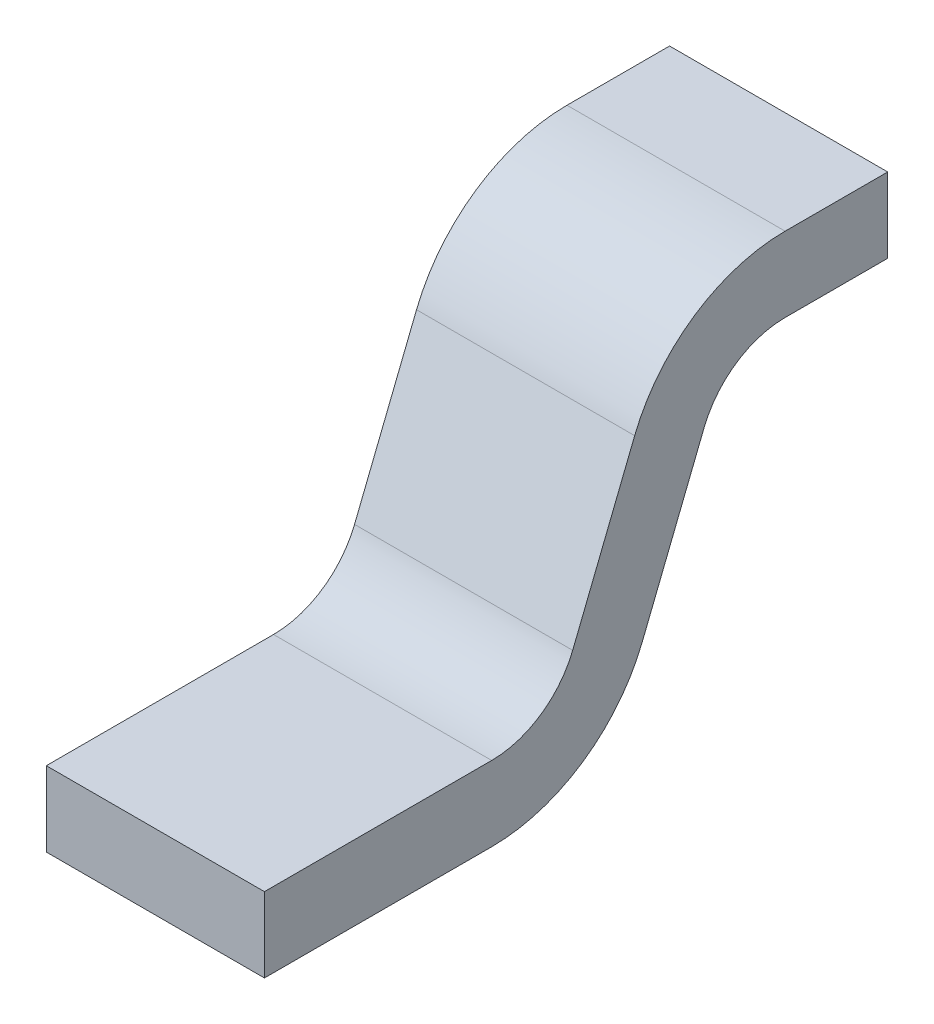
ISO-10303-21;
HEADER;
FILE_DESCRIPTION(('STEP AP214'),'2;1');
FILE_NAME('part.step','',(''),(''),'','','');
FILE_SCHEMA(('AUTOMOTIVE_DESIGN { 1 0 10303 214 1 1 1 1 }'));
ENDSEC;
DATA;
#1=APPLICATION_CONTEXT('core data for automotive mechanical design processes');
#2=APPLICATION_PROTOCOL_DEFINITION('international standard','automotive_design',2000,#1);
#3=PRODUCT_CONTEXT('',#1,'mechanical');
#4=PRODUCT('Part','Part','',(#3));
#5=PRODUCT_RELATED_PRODUCT_CATEGORY('part','',(#4));
#6=PRODUCT_DEFINITION_FORMATION('','',#4);
#7=PRODUCT_DEFINITION_CONTEXT('part definition',#1,'design');
#8=PRODUCT_DEFINITION('design','',#6,#7);
#9=PRODUCT_DEFINITION_SHAPE('','',#8);
#10=(LENGTH_UNIT() NAMED_UNIT(*) SI_UNIT(.MILLI.,.METRE.));
#11=(NAMED_UNIT(*) PLANE_ANGLE_UNIT() SI_UNIT($,.RADIAN.));
#12=(NAMED_UNIT(*) SI_UNIT($,.STERADIAN.) SOLID_ANGLE_UNIT());
#13=UNCERTAINTY_MEASURE_WITH_UNIT(LENGTH_MEASURE(1.E-05),#10,'distance_accuracy_value','');
#14=(GEOMETRIC_REPRESENTATION_CONTEXT(3) GLOBAL_UNCERTAINTY_ASSIGNED_CONTEXT((#13)) GLOBAL_UNIT_ASSIGNED_CONTEXT((#10,
#11,#12)) REPRESENTATION_CONTEXT('',''));
#15=CARTESIAN_POINT('',(0.,0.,0.));
#16=DIRECTION('',(0.,0.,1.));
#17=DIRECTION('',(1.,0.,0.));
#18=AXIS2_PLACEMENT_3D('',#15,#16,#17);
#19=CARTESIAN_POINT('',(0.,0.3,-0.835406592285));
#20=DIRECTION('',(1.,0.,0.));
#21=DIRECTION('',(0.,0.,-1.));
#22=AXIS2_PLACEMENT_3D('',#19,#20,#21);
#23=PLANE('',#22);
#24=DIRECTION('',(0.,-0.928476690885259,0.371390676354104));
#25=VECTOR('',#24,1.);
#26=CARTESIAN_POINT('',(0.,0.103438424148,-0.605997347345));
#27=LINE('',#26,#25);
#28=CARTESIAN_POINT('',(0.,0.351994694689649,-0.705419855561377));
#29=VERTEX_POINT('',#28);
#30=CARTESIAN_POINT('',(0.,0.103438424147967,-0.605997347345084));
#31=VERTEX_POINT('',#30);
#32=EDGE_CURVE('E96',#29,#31,#27,.T.);
#33=ORIENTED_EDGE('',*,*,#32,.T.);
#34=CARTESIAN_POINT('',(0.,0.2,-0.364593407715));
#35=DIRECTION('',(-1.,0.,0.));
#36=DIRECTION('',(0.,0.,1.));
#37=AXIS2_PLACEMENT_3D('',#34,#35,#36);
#38=CIRCLE('',#37,0.26);
#39=CARTESIAN_POINT('',(0.,-0.06,-0.364593407715));
#40=VERTEX_POINT('',#39);
#41=EDGE_CURVE('E168',#40,#31,#38,.F.);
#42=ORIENTED_EDGE('',*,*,#41,.F.);
#43=DIRECTION('',(0.,0.,1.));
#44=VECTOR('',#43,1.);
#45=CARTESIAN_POINT('',(0.,-0.06,0.));
#46=LINE('',#45,#44);
#47=CARTESIAN_POINT('',(0.,-0.06,0.));
#48=VERTEX_POINT('',#47);
#49=EDGE_CURVE('E119',#40,#48,#46,.T.);
#50=ORIENTED_EDGE('',*,*,#49,.T.);
#51=DIRECTION('',(0.,1.,0.));
#52=VECTOR('',#51,1.);
#53=CARTESIAN_POINT('',(0.,-0.06,0.));
#54=LINE('',#53,#52);
#55=CARTESIAN_POINT('',(0.,0.06,0.));
#56=VERTEX_POINT('',#55);
#57=EDGE_CURVE('E123',#56,#48,#54,.F.);
#58=ORIENTED_EDGE('',*,*,#57,.F.);
#59=DIRECTION('',(0.,0.,1.));
#60=VECTOR('',#59,1.);
#61=CARTESIAN_POINT('',(0.,0.06,0.));
#62=LINE('',#61,#60);
#63=CARTESIAN_POINT('',(0.,0.06,-0.364593407715));
#64=VERTEX_POINT('',#63);
#65=EDGE_CURVE('E131',#64,#56,#62,.T.);
#66=ORIENTED_EDGE('',*,*,#65,.F.);
#67=CARTESIAN_POINT('',(0.,0.2,-0.364593407715));
#68=DIRECTION('',(-1.,0.,0.));
#69=DIRECTION('',(0.,0.,1.));
#70=AXIS2_PLACEMENT_3D('',#67,#68,#69);
#71=CIRCLE('',#70,0.14);
#72=CARTESIAN_POINT('',(0.,0.148005305310213,-0.494580144438968));
#73=VERTEX_POINT('',#72);
#74=EDGE_CURVE('E140',#64,#73,#71,.F.);
#75=ORIENTED_EDGE('',*,*,#74,.T.);
#76=DIRECTION('',(0.,-0.928476690885259,0.371390676354104));
#77=VECTOR('',#76,1.);
#78=CARTESIAN_POINT('',(0.,0.14800530531,-0.494580144439));
#79=LINE('',#78,#77);
#80=CARTESIAN_POINT('',(0.,0.396561575851724,-0.59400265265569));
#81=VERTEX_POINT('',#80);
#82=EDGE_CURVE('E137',#81,#73,#79,.T.);
#83=ORIENTED_EDGE('',*,*,#82,.F.);
#84=CARTESIAN_POINT('',(0.,0.3,-0.835406592285));
#85=DIRECTION('',(-1.,0.,0.));
#86=DIRECTION('',(0.,0.,1.));
#87=AXIS2_PLACEMENT_3D('',#84,#85,#86);
#88=CIRCLE('',#87,0.26);
#89=CARTESIAN_POINT('',(0.,0.56,-0.835406592285));
#90=VERTEX_POINT('',#89);
#91=EDGE_CURVE('E171',#90,#81,#88,.F.);
#92=ORIENTED_EDGE('',*,*,#91,.F.);
#93=DIRECTION('',(0.,0.,1.));
#94=VECTOR('',#93,1.);
#95=CARTESIAN_POINT('',(0.,0.56,-0.835406592285));
#96=LINE('',#95,#94);
#97=CARTESIAN_POINT('',(0.,0.56,-1.));
#98=VERTEX_POINT('',#97);
#99=EDGE_CURVE('E142',#98,#90,#96,.T.);
#100=ORIENTED_EDGE('',*,*,#99,.F.);
#101=DIRECTION('',(0.,1.,0.));
#102=VECTOR('',#101,1.);
#103=CARTESIAN_POINT('',(0.,0.56,-1.));
#104=LINE('',#103,#102);
#105=CARTESIAN_POINT('',(0.,0.44,-1.));
#106=VERTEX_POINT('',#105);
#107=EDGE_CURVE('E148',#106,#98,#104,.T.);
#108=ORIENTED_EDGE('',*,*,#107,.F.);
#109=DIRECTION('',(0.,0.,1.));
#110=VECTOR('',#109,1.);
#111=CARTESIAN_POINT('',(0.,0.44,-0.835406592285));
#112=LINE('',#111,#110);
#113=CARTESIAN_POINT('',(0.,0.44,-0.835406592285));
#114=VERTEX_POINT('',#113);
#115=EDGE_CURVE('E92',#106,#114,#112,.T.);
#116=ORIENTED_EDGE('',*,*,#115,.T.);
#117=CARTESIAN_POINT('',(0.,0.3,-0.835406592285));
#118=DIRECTION('',(-1.,0.,0.));
#119=DIRECTION('',(0.,0.,1.));
#120=AXIS2_PLACEMENT_3D('',#117,#118,#119);
#121=CIRCLE('',#120,0.14);
#122=EDGE_CURVE('E20',#114,#29,#121,.F.);
#123=ORIENTED_EDGE('',*,*,#122,.T.);
#124=EDGE_LOOP('',(#33,#42,#50,#58,#66,#75,#83,#92,#100,#108,#116,#123));
#125=FACE_BOUND('',#124,.T.);
#126=ADVANCED_FACE('F17',(#125),#23,.F.);
#127=CARTESIAN_POINT('',(0.35,0.103438424148,-0.605997347345));
#128=DIRECTION('',(0.,0.371390676354104,0.928476690885259));
#129=DIRECTION('',(0.,-0.928476690885259,0.371390676354104));
#130=AXIS2_PLACEMENT_3D('',#127,#128,#129);
#131=PLANE('',#130);
#132=DIRECTION('',(0.,0.92847669088629,-0.371390676351527));
#133=VECTOR('',#132,1.);
#134=CARTESIAN_POINT('',(0.35,0.103438424148,-0.605997347345));
#135=LINE('',#134,#133);
#136=CARTESIAN_POINT('',(0.35,0.103438424148301,-0.605997347345218));
#137=VERTEX_POINT('',#136);
#138=CARTESIAN_POINT('',(0.35,0.351994694689607,-0.70541985556096));
#139=VERTEX_POINT('',#138);
#140=EDGE_CURVE('E167',#137,#139,#135,.T.);
#141=ORIENTED_EDGE('',*,*,#140,.F.);
#142=DIRECTION('',(-1.,0.,0.));
#143=VECTOR('',#142,1.);
#144=CARTESIAN_POINT('',(0.35,0.103438424147933,-0.605997347345167));
#145=LINE('',#144,#143);
#146=EDGE_CURVE('E106',#31,#137,#145,.F.);
#147=ORIENTED_EDGE('',*,*,#146,.F.);
#148=ORIENTED_EDGE('',*,*,#32,.F.);
#149=DIRECTION('',(-1.,0.,0.));
#150=VECTOR('',#149,1.);
#151=CARTESIAN_POINT('',(0.35,0.351994694689919,-0.705419855561202));
#152=LINE('',#151,#150);
#153=EDGE_CURVE('E101',#29,#139,#152,.F.);
#154=ORIENTED_EDGE('',*,*,#153,.T.);
#155=EDGE_LOOP('',(#141,#147,#148,#154));
#156=FACE_BOUND('',#155,.T.);
#157=ADVANCED_FACE('F103',(#156),#131,.F.);
#158=CARTESIAN_POINT('',(0.35,0.3,-0.835406592285));
#159=DIRECTION('',(-1.,0.,0.));
#160=DIRECTION('',(0.,0.,1.));
#161=AXIS2_PLACEMENT_3D('',#158,#159,#160);
#162=CYLINDRICAL_SURFACE('',#161,0.14);
#163=CARTESIAN_POINT('',(0.35,0.3,-0.835406592285));
#164=DIRECTION('',(-1.,0.,0.));
#165=DIRECTION('',(0.,0.,1.));
#166=AXIS2_PLACEMENT_3D('',#163,#164,#165);
#167=CIRCLE('',#166,0.14);
#168=CARTESIAN_POINT('',(0.35,0.44,-0.835406592285));
#169=VERTEX_POINT('',#168);
#170=EDGE_CURVE('E111',#139,#169,#167,.T.);
#171=ORIENTED_EDGE('',*,*,#170,.F.);
#172=ORIENTED_EDGE('',*,*,#153,.F.);
#173=ORIENTED_EDGE('',*,*,#122,.F.);
#174=DIRECTION('',(1.,0.,0.));
#175=VECTOR('',#174,1.);
#176=CARTESIAN_POINT('',(0.35,0.44,-0.835406592285));
#177=LINE('',#176,#175);
#178=EDGE_CURVE('E114',#114,#169,#177,.T.);
#179=ORIENTED_EDGE('',*,*,#178,.T.);
#180=EDGE_LOOP('',(#171,#172,#173,#179));
#181=FACE_BOUND('',#180,.T.);
#182=ADVANCED_FACE('F109',(#181),#162,.F.);
#183=CARTESIAN_POINT('',(0.35,0.44,-0.835406592285));
#184=DIRECTION('',(0.,1.,0.));
#185=DIRECTION('',(0.,0.,1.));
#186=AXIS2_PLACEMENT_3D('',#183,#184,#185);
#187=PLANE('',#186);
#188=DIRECTION('',(0.,0.,-1.));
#189=VECTOR('',#188,1.);
#190=CARTESIAN_POINT('',(0.35,0.44,-0.835406592285));
#191=LINE('',#190,#189);
#192=CARTESIAN_POINT('',(0.35,0.44,-1.));
#193=VERTEX_POINT('',#192);
#194=EDGE_CURVE('E166',#169,#193,#191,.T.);
#195=ORIENTED_EDGE('',*,*,#194,.F.);
#196=ORIENTED_EDGE('',*,*,#178,.F.);
#197=ORIENTED_EDGE('',*,*,#115,.F.);
#198=DIRECTION('',(-1.,0.,0.));
#199=VECTOR('',#198,1.);
#200=CARTESIAN_POINT('',(0.35,0.44,-1.));
#201=LINE('',#200,#199);
#202=EDGE_CURVE('E151',#193,#106,#201,.T.);
#203=ORIENTED_EDGE('',*,*,#202,.F.);
#204=EDGE_LOOP('',(#195,#196,#197,#203));
#205=FACE_BOUND('',#204,.T.);
#206=ADVANCED_FACE('F199',(#205),#187,.F.);
#207=CARTESIAN_POINT('',(0.35,0.56,-1.));
#208=DIRECTION('',(0.,0.,-1.));
#209=DIRECTION('',(-1.,0.,0.));
#210=AXIS2_PLACEMENT_3D('',#207,#208,#209);
#211=PLANE('',#210);
#212=ORIENTED_EDGE('',*,*,#107,.T.);
#213=DIRECTION('',(1.,0.,0.));
#214=VECTOR('',#213,1.);
#215=CARTESIAN_POINT('',(0.35,0.56,-1.));
#216=LINE('',#215,#214);
#217=CARTESIAN_POINT('',(0.35,0.56,-1.));
#218=VERTEX_POINT('',#217);
#219=EDGE_CURVE('E145',#218,#98,#216,.F.);
#220=ORIENTED_EDGE('',*,*,#219,.F.);
#221=DIRECTION('',(0.,1.,0.));
#222=VECTOR('',#221,1.);
#223=CARTESIAN_POINT('',(0.35,0.3,-1.));
#224=LINE('',#223,#222);
#225=EDGE_CURVE('E186',#193,#218,#224,.T.);
#226=ORIENTED_EDGE('',*,*,#225,.F.);
#227=ORIENTED_EDGE('',*,*,#202,.T.);
#228=EDGE_LOOP('',(#212,#220,#226,#227));
#229=FACE_BOUND('',#228,.T.);
#230=ADVANCED_FACE('F250',(#229),#211,.T.);
#231=CARTESIAN_POINT('',(0.35,0.56,-0.835406592285));
#232=DIRECTION('',(0.,1.,0.));
#233=DIRECTION('',(0.,0.,1.));
#234=AXIS2_PLACEMENT_3D('',#231,#232,#233);
#235=PLANE('',#234);
#236=ORIENTED_EDGE('',*,*,#99,.T.);
#237=DIRECTION('',(-1.,0.,0.));
#238=VECTOR('',#237,1.);
#239=CARTESIAN_POINT('',(0.35,0.56,-0.835406592285));
#240=LINE('',#239,#238);
#241=CARTESIAN_POINT('',(0.35,0.56,-0.835406592285));
#242=VERTEX_POINT('',#241);
#243=EDGE_CURVE('E144',#242,#90,#240,.T.);
#244=ORIENTED_EDGE('',*,*,#243,.F.);
#245=DIRECTION('',(0.,0.,-1.));
#246=VECTOR('',#245,1.);
#247=CARTESIAN_POINT('',(0.35,0.56,-0.835406592285));
#248=LINE('',#247,#246);
#249=EDGE_CURVE('E164',#218,#242,#248,.F.);
#250=ORIENTED_EDGE('',*,*,#249,.F.);
#251=ORIENTED_EDGE('',*,*,#219,.T.);
#252=EDGE_LOOP('',(#236,#244,#250,#251));
#253=FACE_BOUND('',#252,.T.);
#254=ADVANCED_FACE('F243',(#253),#235,.T.);
#255=CARTESIAN_POINT('',(0.35,0.3,-0.835406592285));
#256=DIRECTION('',(-1.,0.,0.));
#257=DIRECTION('',(0.,0.,1.));
#258=AXIS2_PLACEMENT_3D('',#255,#256,#257);
#259=CYLINDRICAL_SURFACE('',#258,0.26);
#260=ORIENTED_EDGE('',*,*,#91,.T.);
#261=DIRECTION('',(1.,0.,0.));
#262=VECTOR('',#261,1.);
#263=CARTESIAN_POINT('',(0.35,0.396561575851724,-0.59400265265569));
#264=LINE('',#263,#262);
#265=CARTESIAN_POINT('',(0.35,0.396561575851527,-0.594002652655211));
#266=VERTEX_POINT('',#265);
#267=EDGE_CURVE('E141',#266,#81,#264,.F.);
#268=ORIENTED_EDGE('',*,*,#267,.F.);
#269=CARTESIAN_POINT('',(0.35,0.3,-0.835406592285));
#270=DIRECTION('',(-1.,0.,0.));
#271=DIRECTION('',(0.,0.,1.));
#272=AXIS2_PLACEMENT_3D('',#269,#270,#271);
#273=CIRCLE('',#272,0.26);
#274=EDGE_CURVE('E161',#242,#266,#273,.F.);
#275=ORIENTED_EDGE('',*,*,#274,.F.);
#276=ORIENTED_EDGE('',*,*,#243,.T.);
#277=EDGE_LOOP('',(#260,#268,#275,#276));
#278=FACE_BOUND('',#277,.T.);
#279=ADVANCED_FACE('F252',(#278),#259,.T.);
#280=CARTESIAN_POINT('',(0.35,0.14800530531,-0.494580144439));
#281=DIRECTION('',(0.,0.371390676354104,0.928476690885259));
#282=DIRECTION('',(0.,-0.928476690885259,0.371390676354104));
#283=AXIS2_PLACEMENT_3D('',#280,#281,#282);
#284=PLANE('',#283);
#285=ORIENTED_EDGE('',*,*,#82,.T.);
#286=DIRECTION('',(-1.,0.,0.));
#287=VECTOR('',#286,1.);
#288=CARTESIAN_POINT('',(0.35,0.148005305310081,-0.494580144438798));
#289=LINE('',#288,#287);
#290=CARTESIAN_POINT('',(0.35,0.148005305310393,-0.49458014443904));
#291=VERTEX_POINT('',#290);
#292=EDGE_CURVE('E170',#73,#291,#289,.F.);
#293=ORIENTED_EDGE('',*,*,#292,.T.);
#294=DIRECTION('',(0.,-0.92847669088629,0.371390676351527));
#295=VECTOR('',#294,1.);
#296=CARTESIAN_POINT('',(0.35,0.396561575852,-0.594002652655));
#297=LINE('',#296,#295);
#298=EDGE_CURVE('E160',#266,#291,#297,.T.);
#299=ORIENTED_EDGE('',*,*,#298,.F.);
#300=ORIENTED_EDGE('',*,*,#267,.T.);
#301=EDGE_LOOP('',(#285,#293,#299,#300));
#302=FACE_BOUND('',#301,.T.);
#303=ADVANCED_FACE('F227',(#302),#284,.T.);
#304=CARTESIAN_POINT('',(0.35,0.2,-0.364593407715));
#305=DIRECTION('',(-1.,0.,0.));
#306=DIRECTION('',(0.,0.,1.));
#307=AXIS2_PLACEMENT_3D('',#304,#305,#306);
#308=CYLINDRICAL_SURFACE('',#307,0.14);
#309=CARTESIAN_POINT('',(0.35,0.2,-0.364593407715));
#310=DIRECTION('',(-1.,0.,0.));
#311=DIRECTION('',(0.,0.,1.));
#312=AXIS2_PLACEMENT_3D('',#309,#310,#311);
#313=CIRCLE('',#312,0.14);
#314=CARTESIAN_POINT('',(0.35,0.06,-0.364593407715));
#315=VERTEX_POINT('',#314);
#316=EDGE_CURVE('E156',#291,#315,#313,.T.);
#317=ORIENTED_EDGE('',*,*,#316,.F.);
#318=ORIENTED_EDGE('',*,*,#292,.F.);
#319=ORIENTED_EDGE('',*,*,#74,.F.);
#320=DIRECTION('',(1.,0.,0.));
#321=VECTOR('',#320,1.);
#322=CARTESIAN_POINT('',(0.35,0.06,-0.364593407715));
#323=LINE('',#322,#321);
#324=EDGE_CURVE('E134',#315,#64,#323,.F.);
#325=ORIENTED_EDGE('',*,*,#324,.F.);
#326=EDGE_LOOP('',(#317,#318,#319,#325));
#327=FACE_BOUND('',#326,.T.);
#328=ADVANCED_FACE('F230',(#327),#308,.F.);
#329=CARTESIAN_POINT('',(0.35,0.06,0.));
#330=DIRECTION('',(0.,1.,0.));
#331=DIRECTION('',(0.,0.,1.));
#332=AXIS2_PLACEMENT_3D('',#329,#330,#331);
#333=PLANE('',#332);
#334=ORIENTED_EDGE('',*,*,#65,.T.);
#335=DIRECTION('',(1.,0.,0.));
#336=VECTOR('',#335,1.);
#337=CARTESIAN_POINT('',(0.35,0.06,0.));
#338=LINE('',#337,#336);
#339=CARTESIAN_POINT('',(0.35,0.06,0.));
#340=VERTEX_POINT('',#339);
#341=EDGE_CURVE('E128',#340,#56,#338,.F.);
#342=ORIENTED_EDGE('',*,*,#341,.F.);
#343=DIRECTION('',(0.,0.,-1.));
#344=VECTOR('',#343,1.);
#345=CARTESIAN_POINT('',(0.35,0.06,-0.835406592285));
#346=LINE('',#345,#344);
#347=EDGE_CURVE('E159',#315,#340,#346,.F.);
#348=ORIENTED_EDGE('',*,*,#347,.F.);
#349=ORIENTED_EDGE('',*,*,#324,.T.);
#350=EDGE_LOOP('',(#334,#342,#348,#349));
#351=FACE_BOUND('',#350,.T.);
#352=ADVANCED_FACE('F277',(#351),#333,.T.);
#353=CARTESIAN_POINT('',(0.35,-0.06,0.));
#354=DIRECTION('',(0.,0.,1.));
#355=DIRECTION('',(1.,0.,0.));
#356=AXIS2_PLACEMENT_3D('',#353,#354,#355);
#357=PLANE('',#356);
#358=ORIENTED_EDGE('',*,*,#57,.T.);
#359=DIRECTION('',(1.,0.,0.));
#360=VECTOR('',#359,1.);
#361=CARTESIAN_POINT('',(0.35,-0.06,0.));
#362=LINE('',#361,#360);
#363=CARTESIAN_POINT('',(0.35,-0.06,0.));
#364=VERTEX_POINT('',#363);
#365=EDGE_CURVE('E122',#48,#364,#362,.T.);
#366=ORIENTED_EDGE('',*,*,#365,.T.);
#367=DIRECTION('',(0.,1.,0.));
#368=VECTOR('',#367,1.);
#369=CARTESIAN_POINT('',(0.35,0.3,0.));
#370=LINE('',#369,#368);
#371=EDGE_CURVE('E213',#340,#364,#370,.F.);
#372=ORIENTED_EDGE('',*,*,#371,.F.);
#373=ORIENTED_EDGE('',*,*,#341,.T.);
#374=EDGE_LOOP('',(#358,#366,#372,#373));
#375=FACE_BOUND('',#374,.T.);
#376=ADVANCED_FACE('F274',(#375),#357,.T.);
#377=CARTESIAN_POINT('',(0.35,-0.06,0.));
#378=DIRECTION('',(0.,1.,0.));
#379=DIRECTION('',(0.,0.,1.));
#380=AXIS2_PLACEMENT_3D('',#377,#378,#379);
#381=PLANE('',#380);
#382=DIRECTION('',(0.,0.,-1.));
#383=VECTOR('',#382,1.);
#384=CARTESIAN_POINT('',(0.35,-0.06,-0.835406592285));
#385=LINE('',#384,#383);
#386=CARTESIAN_POINT('',(0.35,-0.06,-0.364593407715));
#387=VERTEX_POINT('',#386);
#388=EDGE_CURVE('E26',#364,#387,#385,.T.);
#389=ORIENTED_EDGE('',*,*,#388,.F.);
#390=ORIENTED_EDGE('',*,*,#365,.F.);
#391=ORIENTED_EDGE('',*,*,#49,.F.);
#392=DIRECTION('',(-1.,0.,0.));
#393=VECTOR('',#392,1.);
#394=CARTESIAN_POINT('',(0.35,-0.06,-0.364593407715));
#395=LINE('',#394,#393);
#396=EDGE_CURVE('E35',#387,#40,#395,.T.);
#397=ORIENTED_EDGE('',*,*,#396,.F.);
#398=EDGE_LOOP('',(#389,#390,#391,#397));
#399=FACE_BOUND('',#398,.T.);
#400=ADVANCED_FACE('F268',(#399),#381,.F.);
#401=CARTESIAN_POINT('',(0.35,0.2,-0.364593407715));
#402=DIRECTION('',(-1.,0.,0.));
#403=DIRECTION('',(0.,0.,1.));
#404=AXIS2_PLACEMENT_3D('',#401,#402,#403);
#405=CYLINDRICAL_SURFACE('',#404,0.26);
#406=ORIENTED_EDGE('',*,*,#41,.T.);
#407=ORIENTED_EDGE('',*,*,#146,.T.);
#408=CARTESIAN_POINT('',(0.35,0.2,-0.364593407715));
#409=DIRECTION('',(-1.,0.,0.));
#410=DIRECTION('',(0.,0.,1.));
#411=AXIS2_PLACEMENT_3D('',#408,#409,#410);
#412=CIRCLE('',#411,0.26);
#413=EDGE_CURVE('E11',#387,#137,#412,.F.);
#414=ORIENTED_EDGE('',*,*,#413,.F.);
#415=ORIENTED_EDGE('',*,*,#396,.T.);
#416=EDGE_LOOP('',(#406,#407,#414,#415));
#417=FACE_BOUND('',#416,.T.);
#418=ADVANCED_FACE('F263',(#417),#405,.T.);
#419=CARTESIAN_POINT('',(0.35,0.3,-0.835406592285));
#420=DIRECTION('',(1.,0.,0.));
#421=DIRECTION('',(0.,0.,-1.));
#422=AXIS2_PLACEMENT_3D('',#419,#420,#421);
#423=PLANE('',#422);
#424=ORIENTED_EDGE('',*,*,#388,.T.);
#425=ORIENTED_EDGE('',*,*,#413,.T.);
#426=ORIENTED_EDGE('',*,*,#140,.T.);
#427=ORIENTED_EDGE('',*,*,#170,.T.);
#428=ORIENTED_EDGE('',*,*,#194,.T.);
#429=ORIENTED_EDGE('',*,*,#225,.T.);
#430=ORIENTED_EDGE('',*,*,#249,.T.);
#431=ORIENTED_EDGE('',*,*,#274,.T.);
#432=ORIENTED_EDGE('',*,*,#298,.T.);
#433=ORIENTED_EDGE('',*,*,#316,.T.);
#434=ORIENTED_EDGE('',*,*,#347,.T.);
#435=ORIENTED_EDGE('',*,*,#371,.T.);
#436=EDGE_LOOP('',(#424,#425,#426,#427,#428,#429,#430,#431,#432,#433,#434,#435));
#437=FACE_BOUND('',#436,.T.);
#438=ADVANCED_FACE('F203',(#437),#423,.T.);
#439=CLOSED_SHELL('',(#126,#157,#182,#206,#230,#254,#279,#303,#328,#352,#376,#400,#418,#438));
#440=MANIFOLD_SOLID_BREP('B1',#439);
#441=ADVANCED_BREP_SHAPE_REPRESENTATION('',(#18,#440),#14);
#442=SHAPE_DEFINITION_REPRESENTATION(#9,#441);
ENDSEC;
END-ISO-10303-21;
